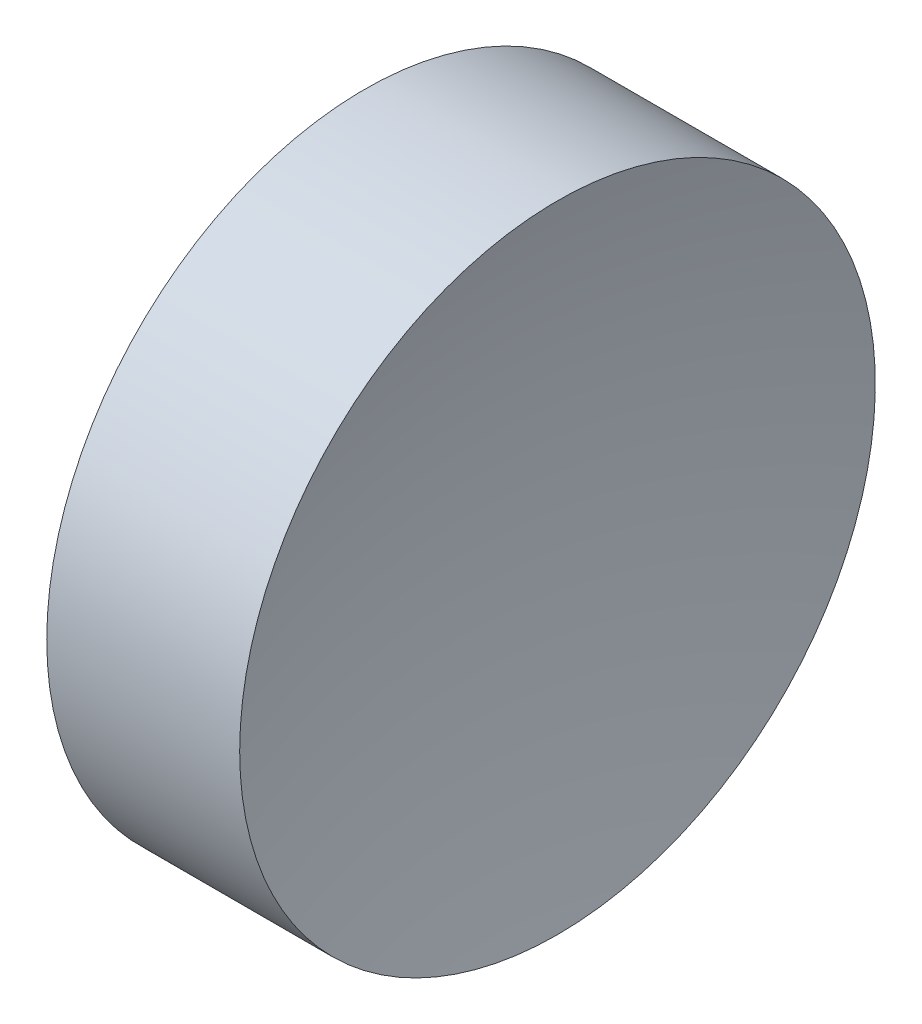
ISO-10303-21;
HEADER;
FILE_DESCRIPTION(('STEP AP214'),'2;1');
FILE_NAME('part.step','',(''),(''),'','','');
FILE_SCHEMA(('AUTOMOTIVE_DESIGN { 1 0 10303 214 1 1 1 1 }'));
ENDSEC;
DATA;
#1=APPLICATION_CONTEXT('core data for automotive mechanical design processes');
#2=APPLICATION_PROTOCOL_DEFINITION('international standard','automotive_design',2000,#1);
#3=PRODUCT_CONTEXT('',#1,'mechanical');
#4=PRODUCT('Part','Part','',(#3));
#5=PRODUCT_RELATED_PRODUCT_CATEGORY('part','',(#4));
#6=PRODUCT_DEFINITION_FORMATION('','',#4);
#7=PRODUCT_DEFINITION_CONTEXT('part definition',#1,'design');
#8=PRODUCT_DEFINITION('design','',#6,#7);
#9=PRODUCT_DEFINITION_SHAPE('','',#8);
#10=(LENGTH_UNIT() NAMED_UNIT(*) SI_UNIT(.MILLI.,.METRE.));
#11=(NAMED_UNIT(*) PLANE_ANGLE_UNIT() SI_UNIT($,.RADIAN.));
#12=(NAMED_UNIT(*) SI_UNIT($,.STERADIAN.) SOLID_ANGLE_UNIT());
#13=UNCERTAINTY_MEASURE_WITH_UNIT(LENGTH_MEASURE(1.E-05),#10,'distance_accuracy_value','');
#14=(GEOMETRIC_REPRESENTATION_CONTEXT(3) GLOBAL_UNCERTAINTY_ASSIGNED_CONTEXT((#13)) GLOBAL_UNIT_ASSIGNED_CONTEXT((#10,
#11,#12)) REPRESENTATION_CONTEXT('',''));
#15=CARTESIAN_POINT('',(0.,0.,0.));
#16=DIRECTION('',(0.,0.,1.));
#17=DIRECTION('',(1.,0.,0.));
#18=AXIS2_PLACEMENT_3D('',#15,#16,#17);
#19=CARTESIAN_POINT('',(171.092655541267,69.3780211233724,0.));
#20=DIRECTION('',(-1.,0.,0.));
#21=DIRECTION('',(0.,-1.,0.));
#22=AXIS2_PLACEMENT_3D('',#19,#20,#21);
#23=SPHERICAL_SURFACE('',#22,50.);
#24=CARTESIAN_POINT('',(122.680363713674,69.3780211233724,0.));
#25=DIRECTION('',(-1.,0.,0.));
#26=DIRECTION('',(0.,0.,1.));
#27=AXIS2_PLACEMENT_3D('',#24,#25,#26);
#28=CIRCLE('',#27,12.5);
#29=CARTESIAN_POINT('',(122.680363713674,69.3780211233724,12.5));
#30=VERTEX_POINT('',#29);
#31=EDGE_CURVE('E10',#30,#30,#28,.T.);
#32=ORIENTED_EDGE('',*,*,#31,.F.);
#33=EDGE_LOOP('',(#32));
#34=FACE_BOUND('',#33,.T.);
#35=ADVANCED_FACE('F35',(#34),#23,.F.);
#36=CARTESIAN_POINT('',(108.985143002165,69.3780211233724,0.));
#37=DIRECTION('',(-1.,0.,0.));
#38=DIRECTION('',(0.,0.,1.));
#39=AXIS2_PLACEMENT_3D('',#36,#37,#38);
#40=CYLINDRICAL_SURFACE('',#39,12.5);
#41=CARTESIAN_POINT('',(115.09265553492,69.3780211233724,0.));
#42=DIRECTION('',(-1.,0.,0.));
#43=DIRECTION('',(0.,0.,1.));
#44=AXIS2_PLACEMENT_3D('',#41,#42,#43);
#45=CIRCLE('',#44,12.5);
#46=CARTESIAN_POINT('',(115.09265553492,69.3780211233724,12.5));
#47=VERTEX_POINT('',#46);
#48=EDGE_CURVE('E41',#47,#47,#45,.T.);
#49=ORIENTED_EDGE('',*,*,#48,.F.);
#50=EDGE_LOOP('',(#49));
#51=FACE_BOUND('',#50,.T.);
#52=ORIENTED_EDGE('',*,*,#31,.T.);
#53=EDGE_LOOP('',(#52));
#54=FACE_BOUND('',#53,.T.);
#55=ADVANCED_FACE('F49',(#51,#54),#40,.T.);
#56=CARTESIAN_POINT('',(115.09265553492,69.3780211233724,0.));
#57=DIRECTION('',(1.,0.,0.));
#58=DIRECTION('',(0.,0.,-1.));
#59=AXIS2_PLACEMENT_3D('',#56,#57,#58);
#60=PLANE('',#59);
#61=ORIENTED_EDGE('',*,*,#48,.T.);
#62=EDGE_LOOP('',(#61));
#63=FACE_BOUND('',#62,.T.);
#64=ADVANCED_FACE('F47',(#63),#60,.F.);
#65=CLOSED_SHELL('',(#35,#55,#64));
#66=MANIFOLD_SOLID_BREP('B2',#65);
#67=ADVANCED_BREP_SHAPE_REPRESENTATION('',(#18,#66),#14);
#68=SHAPE_DEFINITION_REPRESENTATION(#9,#67);
ENDSEC;
END-ISO-10303-21;
